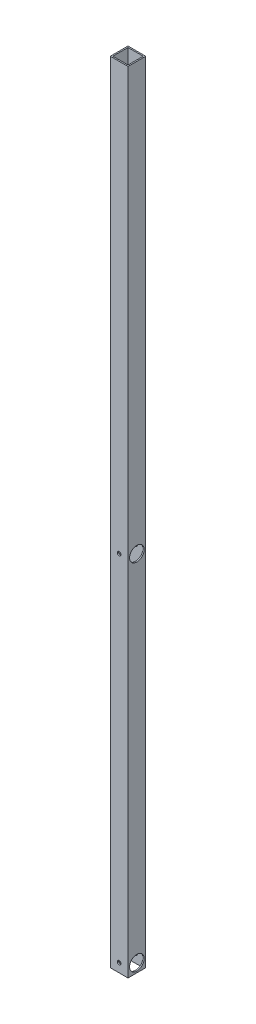
ISO-10303-21;
HEADER;
FILE_DESCRIPTION(('STEP AP214'),'2;1');
FILE_NAME('part.step','',(''),(''),'','','');
FILE_SCHEMA(('AUTOMOTIVE_DESIGN { 1 0 10303 214 1 1 1 1 }'));
ENDSEC;
DATA;
#1=APPLICATION_CONTEXT('core data for automotive mechanical design processes');
#2=APPLICATION_PROTOCOL_DEFINITION('international standard','automotive_design',2000,#1);
#3=PRODUCT_CONTEXT('',#1,'mechanical');
#4=PRODUCT('Part','Part','',(#3));
#5=PRODUCT_RELATED_PRODUCT_CATEGORY('part','',(#4));
#6=PRODUCT_DEFINITION_FORMATION('','',#4);
#7=PRODUCT_DEFINITION_CONTEXT('part definition',#1,'design');
#8=PRODUCT_DEFINITION('design','',#6,#7);
#9=PRODUCT_DEFINITION_SHAPE('','',#8);
#10=(LENGTH_UNIT() NAMED_UNIT(*) SI_UNIT(.MILLI.,.METRE.));
#11=(NAMED_UNIT(*) PLANE_ANGLE_UNIT() SI_UNIT($,.RADIAN.));
#12=(NAMED_UNIT(*) SI_UNIT($,.STERADIAN.) SOLID_ANGLE_UNIT());
#13=UNCERTAINTY_MEASURE_WITH_UNIT(LENGTH_MEASURE(1.E-05),#10,'distance_accuracy_value','');
#14=(GEOMETRIC_REPRESENTATION_CONTEXT(3) GLOBAL_UNCERTAINTY_ASSIGNED_CONTEXT((#13)) GLOBAL_UNIT_ASSIGNED_CONTEXT((#10,
#11,#12)) REPRESENTATION_CONTEXT('',''));
#15=CARTESIAN_POINT('',(0.,0.,0.));
#16=DIRECTION('',(0.,0.,1.));
#17=DIRECTION('',(1.,0.,0.));
#18=AXIS2_PLACEMENT_3D('',#15,#16,#17);
#19=CARTESIAN_POINT('',(22.225,22.225,0.));
#20=DIRECTION('',(0.,0.,1.));
#21=DIRECTION('',(1.,0.,0.));
#22=AXIS2_PLACEMENT_3D('',#19,#20,#21);
#23=CYLINDRICAL_SURFACE('',#22,4.7625);
#24=CARTESIAN_POINT('',(22.225,22.225,-41.275));
#25=DIRECTION('',(0.,0.,1.));
#26=DIRECTION('',(1.,0.,0.));
#27=AXIS2_PLACEMENT_3D('',#24,#25,#26);
#28=CIRCLE('',#27,4.7625);
#29=CARTESIAN_POINT('',(26.9875,22.225,-41.275));
#30=VERTEX_POINT('',#29);
#31=EDGE_CURVE('E122',#30,#30,#28,.F.);
#32=ORIENTED_EDGE('',*,*,#31,.F.);
#33=EDGE_LOOP('',(#32));
#34=FACE_BOUND('',#33,.T.);
#35=CARTESIAN_POINT('',(22.225,22.225,-44.45));
#36=DIRECTION('',(0.,0.,1.));
#37=DIRECTION('',(1.,0.,0.));
#38=AXIS2_PLACEMENT_3D('',#35,#36,#37);
#39=CIRCLE('',#38,4.7625);
#40=CARTESIAN_POINT('',(26.9875,22.225,-44.45));
#41=VERTEX_POINT('',#40);
#42=EDGE_CURVE('E19',#41,#41,#39,.T.);
#43=ORIENTED_EDGE('',*,*,#42,.F.);
#44=EDGE_LOOP('',(#43));
#45=FACE_BOUND('',#44,.T.);
#46=ADVANCED_FACE('F16',(#34,#45),#23,.F.);
#47=CARTESIAN_POINT('',(22.225,911.225,0.));
#48=DIRECTION('',(0.,0.,1.));
#49=DIRECTION('',(1.,0.,0.));
#50=AXIS2_PLACEMENT_3D('',#47,#48,#49);
#51=CYLINDRICAL_SURFACE('',#50,4.7625);
#52=CARTESIAN_POINT('',(22.225,911.225,-41.275));
#53=DIRECTION('',(0.,0.,1.));
#54=DIRECTION('',(1.,0.,0.));
#55=AXIS2_PLACEMENT_3D('',#52,#53,#54);
#56=CIRCLE('',#55,4.7625);
#57=CARTESIAN_POINT('',(26.9875,911.225,-41.275));
#58=VERTEX_POINT('',#57);
#59=EDGE_CURVE('E91',#58,#58,#56,.F.);
#60=ORIENTED_EDGE('',*,*,#59,.F.);
#61=EDGE_LOOP('',(#60));
#62=FACE_BOUND('',#61,.T.);
#63=CARTESIAN_POINT('',(22.225,911.225,-44.45));
#64=DIRECTION('',(0.,0.,1.));
#65=DIRECTION('',(1.,0.,0.));
#66=AXIS2_PLACEMENT_3D('',#63,#64,#65);
#67=CIRCLE('',#66,4.7625);
#68=CARTESIAN_POINT('',(26.9875,911.225,-44.45));
#69=VERTEX_POINT('',#68);
#70=EDGE_CURVE('E163',#69,#69,#67,.T.);
#71=ORIENTED_EDGE('',*,*,#70,.F.);
#72=EDGE_LOOP('',(#71));
#73=FACE_BOUND('',#72,.T.);
#74=ADVANCED_FACE('F174',(#62,#73),#51,.F.);
#75=CARTESIAN_POINT('',(44.45,22.225,-22.225));
#76=DIRECTION('',(1.,0.,0.));
#77=DIRECTION('',(0.,0.,-1.));
#78=AXIS2_PLACEMENT_3D('',#75,#76,#77);
#79=CYLINDRICAL_SURFACE('',#78,18.25625);
#80=CARTESIAN_POINT('',(41.275,22.225,-22.225));
#81=DIRECTION('',(1.,0.,0.));
#82=DIRECTION('',(0.,0.,-1.));
#83=AXIS2_PLACEMENT_3D('',#80,#81,#82);
#84=CIRCLE('',#83,18.25625);
#85=CARTESIAN_POINT('',(41.275,22.225,-40.48125));
#86=VERTEX_POINT('',#85);
#87=EDGE_CURVE('E161',#86,#86,#84,.T.);
#88=ORIENTED_EDGE('',*,*,#87,.F.);
#89=EDGE_LOOP('',(#88));
#90=FACE_BOUND('',#89,.T.);
#91=CARTESIAN_POINT('',(44.45,22.225,-22.225));
#92=DIRECTION('',(1.,0.,0.));
#93=DIRECTION('',(0.,0.,-1.));
#94=AXIS2_PLACEMENT_3D('',#91,#92,#93);
#95=CIRCLE('',#94,18.25625);
#96=CARTESIAN_POINT('',(44.45,22.225,-40.48125));
#97=VERTEX_POINT('',#96);
#98=EDGE_CURVE('E119',#97,#97,#95,.F.);
#99=ORIENTED_EDGE('',*,*,#98,.F.);
#100=EDGE_LOOP('',(#99));
#101=FACE_BOUND('',#100,.T.);
#102=ADVANCED_FACE('F180',(#90,#101),#79,.F.);
#103=CARTESIAN_POINT('',(44.45,911.225,-22.225));
#104=DIRECTION('',(1.,0.,0.));
#105=DIRECTION('',(0.,0.,-1.));
#106=AXIS2_PLACEMENT_3D('',#103,#104,#105);
#107=CYLINDRICAL_SURFACE('',#106,18.25625);
#108=CARTESIAN_POINT('',(41.275,911.225,-22.225));
#109=DIRECTION('',(1.,0.,0.));
#110=DIRECTION('',(0.,0.,-1.));
#111=AXIS2_PLACEMENT_3D('',#108,#109,#110);
#112=CIRCLE('',#111,18.25625);
#113=CARTESIAN_POINT('',(41.275,911.225,-40.48125));
#114=VERTEX_POINT('',#113);
#115=EDGE_CURVE('E158',#114,#114,#112,.T.);
#116=ORIENTED_EDGE('',*,*,#115,.F.);
#117=EDGE_LOOP('',(#116));
#118=FACE_BOUND('',#117,.T.);
#119=CARTESIAN_POINT('',(44.45,911.225,-22.225));
#120=DIRECTION('',(1.,0.,0.));
#121=DIRECTION('',(0.,0.,-1.));
#122=AXIS2_PLACEMENT_3D('',#119,#120,#121);
#123=CIRCLE('',#122,18.25625);
#124=CARTESIAN_POINT('',(44.45,911.225,-40.48125));
#125=VERTEX_POINT('',#124);
#126=EDGE_CURVE('E115',#125,#125,#123,.F.);
#127=ORIENTED_EDGE('',*,*,#126,.F.);
#128=EDGE_LOOP('',(#127));
#129=FACE_BOUND('',#128,.T.);
#130=ADVANCED_FACE('F236',(#118,#129),#107,.F.);
#131=CARTESIAN_POINT('',(44.45,22.225,-22.225));
#132=DIRECTION('',(1.,0.,0.));
#133=DIRECTION('',(0.,0.,-1.));
#134=AXIS2_PLACEMENT_3D('',#131,#132,#133);
#135=CYLINDRICAL_SURFACE('',#134,18.25625);
#136=CARTESIAN_POINT('',(3.175,22.225,-22.225));
#137=DIRECTION('',(1.,0.,0.));
#138=DIRECTION('',(0.,0.,-1.));
#139=AXIS2_PLACEMENT_3D('',#136,#137,#138);
#140=CIRCLE('',#139,18.25625);
#141=CARTESIAN_POINT('',(3.175,22.225,-40.48125));
#142=VERTEX_POINT('',#141);
#143=EDGE_CURVE('E155',#142,#142,#140,.F.);
#144=ORIENTED_EDGE('',*,*,#143,.F.);
#145=EDGE_LOOP('',(#144));
#146=FACE_BOUND('',#145,.T.);
#147=CARTESIAN_POINT('',(0.,22.225,-22.225));
#148=DIRECTION('',(1.,0.,0.));
#149=DIRECTION('',(0.,0.,-1.));
#150=AXIS2_PLACEMENT_3D('',#147,#148,#149);
#151=CIRCLE('',#150,18.25625);
#152=CARTESIAN_POINT('',(0.,22.225,-40.48125));
#153=VERTEX_POINT('',#152);
#154=EDGE_CURVE('E141',#153,#153,#151,.T.);
#155=ORIENTED_EDGE('',*,*,#154,.F.);
#156=EDGE_LOOP('',(#155));
#157=FACE_BOUND('',#156,.T.);
#158=ADVANCED_FACE('F232',(#146,#157),#135,.F.);
#159=CARTESIAN_POINT('',(44.45,911.225,-22.225));
#160=DIRECTION('',(1.,0.,0.));
#161=DIRECTION('',(0.,0.,-1.));
#162=AXIS2_PLACEMENT_3D('',#159,#160,#161);
#163=CYLINDRICAL_SURFACE('',#162,18.25625);
#164=CARTESIAN_POINT('',(3.175,911.225,-22.225));
#165=DIRECTION('',(1.,0.,0.));
#166=DIRECTION('',(0.,0.,-1.));
#167=AXIS2_PLACEMENT_3D('',#164,#165,#166);
#168=CIRCLE('',#167,18.25625);
#169=CARTESIAN_POINT('',(3.175,911.225,-40.48125));
#170=VERTEX_POINT('',#169);
#171=EDGE_CURVE('E124',#170,#170,#168,.F.);
#172=ORIENTED_EDGE('',*,*,#171,.F.);
#173=EDGE_LOOP('',(#172));
#174=FACE_BOUND('',#173,.T.);
#175=CARTESIAN_POINT('',(0.,911.225,-22.225));
#176=DIRECTION('',(1.,0.,0.));
#177=DIRECTION('',(0.,0.,-1.));
#178=AXIS2_PLACEMENT_3D('',#175,#176,#177);
#179=CIRCLE('',#178,18.25625);
#180=CARTESIAN_POINT('',(0.,911.225,-40.48125));
#181=VERTEX_POINT('',#180);
#182=EDGE_CURVE('E137',#181,#181,#179,.T.);
#183=ORIENTED_EDGE('',*,*,#182,.F.);
#184=EDGE_LOOP('',(#183));
#185=FACE_BOUND('',#184,.T.);
#186=ADVANCED_FACE('F229',(#174,#185),#163,.F.);
#187=CARTESIAN_POINT('',(44.45,0.,-44.45));
#188=DIRECTION('',(0.,0.,-1.));
#189=DIRECTION('',(-1.,0.,0.));
#190=AXIS2_PLACEMENT_3D('',#187,#188,#189);
#191=PLANE('',#190);
#192=ORIENTED_EDGE('',*,*,#70,.T.);
#193=EDGE_LOOP('',(#192));
#194=FACE_BOUND('',#193,.T.);
#195=ORIENTED_EDGE('',*,*,#42,.T.);
#196=EDGE_LOOP('',(#195));
#197=FACE_BOUND('',#196,.T.);
#198=DIRECTION('',(0.,1.,0.));
#199=VECTOR('',#198,1.);
#200=CARTESIAN_POINT('',(44.45,0.,-44.45));
#201=LINE('',#200,#199);
#202=CARTESIAN_POINT('',(44.45,0.,-44.45));
#203=VERTEX_POINT('',#202);
#204=CARTESIAN_POINT('',(44.45,1981.2,-44.45));
#205=VERTEX_POINT('',#204);
#206=EDGE_CURVE('E116',#203,#205,#201,.T.);
#207=ORIENTED_EDGE('',*,*,#206,.F.);
#208=DIRECTION('',(1.,0.,0.));
#209=VECTOR('',#208,1.);
#210=CARTESIAN_POINT('',(0.,0.,-44.45));
#211=LINE('',#210,#209);
#212=CARTESIAN_POINT('',(0.,0.,-44.45));
#213=VERTEX_POINT('',#212);
#214=EDGE_CURVE('E262',#203,#213,#211,.F.);
#215=ORIENTED_EDGE('',*,*,#214,.T.);
#216=DIRECTION('',(0.,1.,0.));
#217=VECTOR('',#216,1.);
#218=CARTESIAN_POINT('',(0.,0.,-44.45));
#219=LINE('',#218,#217);
#220=CARTESIAN_POINT('',(0.,1981.2,-44.45));
#221=VERTEX_POINT('',#220);
#222=EDGE_CURVE('E144',#221,#213,#219,.F.);
#223=ORIENTED_EDGE('',*,*,#222,.F.);
#224=DIRECTION('',(1.,0.,0.));
#225=VECTOR('',#224,1.);
#226=CARTESIAN_POINT('',(0.,1981.2,-44.45));
#227=LINE('',#226,#225);
#228=EDGE_CURVE('E107',#205,#221,#227,.F.);
#229=ORIENTED_EDGE('',*,*,#228,.F.);
#230=EDGE_LOOP('',(#207,#215,#223,#229));
#231=FACE_BOUND('',#230,.T.);
#232=ADVANCED_FACE('F170',(#194,#197,#231),#191,.T.);
#233=CARTESIAN_POINT('',(41.275,0.,-41.275));
#234=DIRECTION('',(-1.,0.,0.));
#235=DIRECTION('',(0.,0.,1.));
#236=AXIS2_PLACEMENT_3D('',#233,#234,#235);
#237=PLANE('',#236);
#238=ORIENTED_EDGE('',*,*,#115,.T.);
#239=EDGE_LOOP('',(#238));
#240=FACE_BOUND('',#239,.T.);
#241=ORIENTED_EDGE('',*,*,#87,.T.);
#242=EDGE_LOOP('',(#241));
#243=FACE_BOUND('',#242,.T.);
#244=DIRECTION('',(0.,1.,0.));
#245=VECTOR('',#244,1.);
#246=CARTESIAN_POINT('',(41.275,0.,-41.275));
#247=LINE('',#246,#245);
#248=CARTESIAN_POINT('',(41.275,0.,-41.275));
#249=VERTEX_POINT('',#248);
#250=CARTESIAN_POINT('',(41.275,1981.2,-41.275));
#251=VERTEX_POINT('',#250);
#252=EDGE_CURVE('E123',#249,#251,#247,.T.);
#253=ORIENTED_EDGE('',*,*,#252,.F.);
#254=DIRECTION('',(0.,0.,1.));
#255=VECTOR('',#254,1.);
#256=CARTESIAN_POINT('',(41.275,0.,0.));
#257=LINE('',#256,#255);
#258=CARTESIAN_POINT('',(41.275,0.,-3.175));
#259=VERTEX_POINT('',#258);
#260=EDGE_CURVE('E274',#249,#259,#257,.T.);
#261=ORIENTED_EDGE('',*,*,#260,.T.);
#262=DIRECTION('',(0.,1.,0.));
#263=VECTOR('',#262,1.);
#264=CARTESIAN_POINT('',(41.275,0.,-3.175));
#265=LINE('',#264,#263);
#266=CARTESIAN_POINT('',(41.275,1981.2,-3.175));
#267=VERTEX_POINT('',#266);
#268=EDGE_CURVE('E90',#267,#259,#265,.F.);
#269=ORIENTED_EDGE('',*,*,#268,.F.);
#270=DIRECTION('',(0.,0.,1.));
#271=VECTOR('',#270,1.);
#272=CARTESIAN_POINT('',(41.275,1981.2,0.));
#273=LINE('',#272,#271);
#274=EDGE_CURVE('E106',#251,#267,#273,.T.);
#275=ORIENTED_EDGE('',*,*,#274,.F.);
#276=EDGE_LOOP('',(#253,#261,#269,#275));
#277=FACE_BOUND('',#276,.T.);
#278=ADVANCED_FACE('F222',(#240,#243,#277),#237,.T.);
#279=CARTESIAN_POINT('',(3.175,0.,-3.175));
#280=DIRECTION('',(1.,0.,0.));
#281=DIRECTION('',(0.,0.,-1.));
#282=AXIS2_PLACEMENT_3D('',#279,#280,#281);
#283=PLANE('',#282);
#284=ORIENTED_EDGE('',*,*,#171,.T.);
#285=EDGE_LOOP('',(#284));
#286=FACE_BOUND('',#285,.T.);
#287=ORIENTED_EDGE('',*,*,#143,.T.);
#288=EDGE_LOOP('',(#287));
#289=FACE_BOUND('',#288,.T.);
#290=DIRECTION('',(0.,1.,0.));
#291=VECTOR('',#290,1.);
#292=CARTESIAN_POINT('',(3.175,0.,-3.175));
#293=LINE('',#292,#291);
#294=CARTESIAN_POINT('',(3.175,0.,-3.175));
#295=VERTEX_POINT('',#294);
#296=CARTESIAN_POINT('',(3.175,1981.2,-3.175));
#297=VERTEX_POINT('',#296);
#298=EDGE_CURVE('E79',#295,#297,#293,.T.);
#299=ORIENTED_EDGE('',*,*,#298,.F.);
#300=DIRECTION('',(0.,0.,1.));
#301=VECTOR('',#300,1.);
#302=CARTESIAN_POINT('',(3.175,0.,0.));
#303=LINE('',#302,#301);
#304=CARTESIAN_POINT('',(3.175,0.,-41.275));
#305=VERTEX_POINT('',#304);
#306=EDGE_CURVE('E271',#295,#305,#303,.F.);
#307=ORIENTED_EDGE('',*,*,#306,.T.);
#308=DIRECTION('',(0.,1.,0.));
#309=VECTOR('',#308,1.);
#310=CARTESIAN_POINT('',(3.175,0.,-41.275));
#311=LINE('',#310,#309);
#312=CARTESIAN_POINT('',(3.175,1981.2,-41.275));
#313=VERTEX_POINT('',#312);
#314=EDGE_CURVE('E97',#313,#305,#311,.F.);
#315=ORIENTED_EDGE('',*,*,#314,.F.);
#316=DIRECTION('',(0.,0.,1.));
#317=VECTOR('',#316,1.);
#318=CARTESIAN_POINT('',(3.175,1981.2,0.));
#319=LINE('',#318,#317);
#320=EDGE_CURVE('E94',#297,#313,#319,.F.);
#321=ORIENTED_EDGE('',*,*,#320,.F.);
#322=EDGE_LOOP('',(#299,#307,#315,#321));
#323=FACE_BOUND('',#322,.T.);
#324=ADVANCED_FACE('F95',(#286,#289,#323),#283,.T.);
#325=CARTESIAN_POINT('',(3.175,0.,-41.275));
#326=DIRECTION('',(0.,0.,1.));
#327=DIRECTION('',(1.,0.,0.));
#328=AXIS2_PLACEMENT_3D('',#325,#326,#327);
#329=PLANE('',#328);
#330=ORIENTED_EDGE('',*,*,#59,.T.);
#331=EDGE_LOOP('',(#330));
#332=FACE_BOUND('',#331,.T.);
#333=ORIENTED_EDGE('',*,*,#31,.T.);
#334=EDGE_LOOP('',(#333));
#335=FACE_BOUND('',#334,.T.);
#336=ORIENTED_EDGE('',*,*,#314,.T.);
#337=DIRECTION('',(1.,0.,0.));
#338=VECTOR('',#337,1.);
#339=CARTESIAN_POINT('',(0.,0.,-41.275));
#340=LINE('',#339,#338);
#341=EDGE_CURVE('E136',#305,#249,#340,.T.);
#342=ORIENTED_EDGE('',*,*,#341,.T.);
#343=ORIENTED_EDGE('',*,*,#252,.T.);
#344=DIRECTION('',(1.,0.,0.));
#345=VECTOR('',#344,1.);
#346=CARTESIAN_POINT('',(0.,1981.2,-41.275));
#347=LINE('',#346,#345);
#348=EDGE_CURVE('E101',#313,#251,#347,.T.);
#349=ORIENTED_EDGE('',*,*,#348,.F.);
#350=EDGE_LOOP('',(#336,#342,#343,#349));
#351=FACE_BOUND('',#350,.T.);
#352=ADVANCED_FACE('F215',(#332,#335,#351),#329,.T.);
#353=CARTESIAN_POINT('',(41.275,0.,-3.175));
#354=DIRECTION('',(0.,0.,-1.));
#355=DIRECTION('',(-1.,0.,0.));
#356=AXIS2_PLACEMENT_3D('',#353,#354,#355);
#357=PLANE('',#356);
#358=CARTESIAN_POINT('',(22.225,911.225,-3.175));
#359=DIRECTION('',(0.,0.,1.));
#360=DIRECTION('',(1.,0.,0.));
#361=AXIS2_PLACEMENT_3D('',#358,#359,#360);
#362=CIRCLE('',#361,4.7625);
#363=CARTESIAN_POINT('',(26.9875,911.225,-3.175));
#364=VERTEX_POINT('',#363);
#365=EDGE_CURVE('E129',#364,#364,#362,.T.);
#366=ORIENTED_EDGE('',*,*,#365,.T.);
#367=EDGE_LOOP('',(#366));
#368=FACE_BOUND('',#367,.T.);
#369=CARTESIAN_POINT('',(22.225,22.225,-3.175));
#370=DIRECTION('',(0.,0.,1.));
#371=DIRECTION('',(1.,0.,0.));
#372=AXIS2_PLACEMENT_3D('',#369,#370,#371);
#373=CIRCLE('',#372,4.7625);
#374=CARTESIAN_POINT('',(26.9875,22.225,-3.175));
#375=VERTEX_POINT('',#374);
#376=EDGE_CURVE('E133',#375,#375,#373,.T.);
#377=ORIENTED_EDGE('',*,*,#376,.T.);
#378=EDGE_LOOP('',(#377));
#379=FACE_BOUND('',#378,.T.);
#380=ORIENTED_EDGE('',*,*,#268,.T.);
#381=DIRECTION('',(1.,0.,0.));
#382=VECTOR('',#381,1.);
#383=CARTESIAN_POINT('',(0.,0.,-3.175));
#384=LINE('',#383,#382);
#385=EDGE_CURVE('E87',#259,#295,#384,.F.);
#386=ORIENTED_EDGE('',*,*,#385,.T.);
#387=ORIENTED_EDGE('',*,*,#298,.T.);
#388=DIRECTION('',(1.,0.,0.));
#389=VECTOR('',#388,1.);
#390=CARTESIAN_POINT('',(0.,1981.2,-3.175));
#391=LINE('',#390,#389);
#392=EDGE_CURVE('E84',#267,#297,#391,.F.);
#393=ORIENTED_EDGE('',*,*,#392,.F.);
#394=EDGE_LOOP('',(#380,#386,#387,#393));
#395=FACE_BOUND('',#394,.T.);
#396=ADVANCED_FACE('F82',(#368,#379,#395),#357,.T.);
#397=CARTESIAN_POINT('',(44.45,0.,0.));
#398=DIRECTION('',(1.,0.,0.));
#399=DIRECTION('',(0.,0.,-1.));
#400=AXIS2_PLACEMENT_3D('',#397,#398,#399);
#401=PLANE('',#400);
#402=ORIENTED_EDGE('',*,*,#126,.T.);
#403=EDGE_LOOP('',(#402));
#404=FACE_BOUND('',#403,.T.);
#405=ORIENTED_EDGE('',*,*,#98,.T.);
#406=EDGE_LOOP('',(#405));
#407=FACE_BOUND('',#406,.T.);
#408=DIRECTION('',(0.,1.,0.));
#409=VECTOR('',#408,1.);
#410=CARTESIAN_POINT('',(44.45,0.,0.));
#411=LINE('',#410,#409);
#412=CARTESIAN_POINT('',(44.45,0.,0.));
#413=VERTEX_POINT('',#412);
#414=CARTESIAN_POINT('',(44.45,1981.2,0.));
#415=VERTEX_POINT('',#414);
#416=EDGE_CURVE('E132',#413,#415,#411,.T.);
#417=ORIENTED_EDGE('',*,*,#416,.F.);
#418=DIRECTION('',(0.,0.,1.));
#419=VECTOR('',#418,1.);
#420=CARTESIAN_POINT('',(44.45,0.,0.));
#421=LINE('',#420,#419);
#422=EDGE_CURVE('E140',#413,#203,#421,.F.);
#423=ORIENTED_EDGE('',*,*,#422,.T.);
#424=ORIENTED_EDGE('',*,*,#206,.T.);
#425=DIRECTION('',(0.,0.,1.));
#426=VECTOR('',#425,1.);
#427=CARTESIAN_POINT('',(44.45,1981.2,0.));
#428=LINE('',#427,#426);
#429=EDGE_CURVE('E109',#415,#205,#428,.F.);
#430=ORIENTED_EDGE('',*,*,#429,.F.);
#431=EDGE_LOOP('',(#417,#423,#424,#430));
#432=FACE_BOUND('',#431,.T.);
#433=ADVANCED_FACE('F209',(#404,#407,#432),#401,.T.);
#434=CARTESIAN_POINT('',(0.,1981.2,0.));
#435=DIRECTION('',(0.,1.,0.));
#436=DIRECTION('',(0.,0.,1.));
#437=AXIS2_PLACEMENT_3D('',#434,#435,#436);
#438=PLANE('',#437);
#439=ORIENTED_EDGE('',*,*,#348,.T.);
#440=ORIENTED_EDGE('',*,*,#274,.T.);
#441=ORIENTED_EDGE('',*,*,#392,.T.);
#442=ORIENTED_EDGE('',*,*,#320,.T.);
#443=EDGE_LOOP('',(#439,#440,#441,#442));
#444=FACE_BOUND('',#443,.T.);
#445=DIRECTION('',(0.,0.,1.));
#446=VECTOR('',#445,1.);
#447=CARTESIAN_POINT('',(0.,1981.2,-44.45));
#448=LINE('',#447,#446);
#449=CARTESIAN_POINT('',(0.,1981.2,0.));
#450=VERTEX_POINT('',#449);
#451=EDGE_CURVE('E279',#450,#221,#448,.F.);
#452=ORIENTED_EDGE('',*,*,#451,.F.);
#453=DIRECTION('',(1.,0.,0.));
#454=VECTOR('',#453,1.);
#455=CARTESIAN_POINT('',(0.,1981.2,0.));
#456=LINE('',#455,#454);
#457=EDGE_CURVE('E258',#415,#450,#456,.F.);
#458=ORIENTED_EDGE('',*,*,#457,.F.);
#459=ORIENTED_EDGE('',*,*,#429,.T.);
#460=ORIENTED_EDGE('',*,*,#228,.T.);
#461=EDGE_LOOP('',(#452,#458,#459,#460));
#462=FACE_BOUND('',#461,.T.);
#463=ADVANCED_FACE('F103',(#444,#462),#438,.T.);
#464=CARTESIAN_POINT('',(0.,0.,-44.45));
#465=DIRECTION('',(-1.,0.,0.));
#466=DIRECTION('',(0.,0.,1.));
#467=AXIS2_PLACEMENT_3D('',#464,#465,#466);
#468=PLANE('',#467);
#469=ORIENTED_EDGE('',*,*,#182,.T.);
#470=EDGE_LOOP('',(#469));
#471=FACE_BOUND('',#470,.T.);
#472=ORIENTED_EDGE('',*,*,#154,.T.);
#473=EDGE_LOOP('',(#472));
#474=FACE_BOUND('',#473,.T.);
#475=ORIENTED_EDGE('',*,*,#222,.T.);
#476=DIRECTION('',(0.,0.,1.));
#477=VECTOR('',#476,1.);
#478=CARTESIAN_POINT('',(0.,0.,0.));
#479=LINE('',#478,#477);
#480=CARTESIAN_POINT('',(0.,0.,0.));
#481=VERTEX_POINT('',#480);
#482=EDGE_CURVE('E34',#213,#481,#479,.T.);
#483=ORIENTED_EDGE('',*,*,#482,.T.);
#484=DIRECTION('',(0.,1.,0.));
#485=VECTOR('',#484,1.);
#486=CARTESIAN_POINT('',(0.,0.,0.));
#487=LINE('',#486,#485);
#488=EDGE_CURVE('E264',#450,#481,#487,.F.);
#489=ORIENTED_EDGE('',*,*,#488,.F.);
#490=ORIENTED_EDGE('',*,*,#451,.T.);
#491=EDGE_LOOP('',(#475,#483,#489,#490));
#492=FACE_BOUND('',#491,.T.);
#493=ADVANCED_FACE('F202',(#471,#474,#492),#468,.T.);
#494=CARTESIAN_POINT('',(0.,0.,0.));
#495=DIRECTION('',(0.,1.,0.));
#496=DIRECTION('',(0.,0.,1.));
#497=AXIS2_PLACEMENT_3D('',#494,#495,#496);
#498=PLANE('',#497);
#499=ORIENTED_EDGE('',*,*,#306,.F.);
#500=ORIENTED_EDGE('',*,*,#385,.F.);
#501=ORIENTED_EDGE('',*,*,#260,.F.);
#502=ORIENTED_EDGE('',*,*,#341,.F.);
#503=EDGE_LOOP('',(#499,#500,#501,#502));
#504=FACE_BOUND('',#503,.T.);
#505=ORIENTED_EDGE('',*,*,#214,.F.);
#506=ORIENTED_EDGE('',*,*,#422,.F.);
#507=DIRECTION('',(1.,0.,0.));
#508=VECTOR('',#507,1.);
#509=CARTESIAN_POINT('',(0.,0.,0.));
#510=LINE('',#509,#508);
#511=EDGE_CURVE('E128',#481,#413,#510,.T.);
#512=ORIENTED_EDGE('',*,*,#511,.F.);
#513=ORIENTED_EDGE('',*,*,#482,.F.);
#514=EDGE_LOOP('',(#505,#506,#512,#513));
#515=FACE_BOUND('',#514,.T.);
#516=ADVANCED_FACE('F198',(#504,#515),#498,.F.);
#517=CARTESIAN_POINT('',(22.225,22.225,0.));
#518=DIRECTION('',(0.,0.,1.));
#519=DIRECTION('',(1.,0.,0.));
#520=AXIS2_PLACEMENT_3D('',#517,#518,#519);
#521=CYLINDRICAL_SURFACE('',#520,4.7625);
#522=ORIENTED_EDGE('',*,*,#376,.F.);
#523=EDGE_LOOP('',(#522));
#524=FACE_BOUND('',#523,.T.);
#525=CARTESIAN_POINT('',(22.225,22.225,0.));
#526=DIRECTION('',(0.,0.,1.));
#527=DIRECTION('',(1.,0.,0.));
#528=AXIS2_PLACEMENT_3D('',#525,#526,#527);
#529=CIRCLE('',#528,4.7625);
#530=CARTESIAN_POINT('',(26.9875,22.225,0.));
#531=VERTEX_POINT('',#530);
#532=EDGE_CURVE('E25',#531,#531,#529,.F.);
#533=ORIENTED_EDGE('',*,*,#532,.F.);
#534=EDGE_LOOP('',(#533));
#535=FACE_BOUND('',#534,.T.);
#536=ADVANCED_FACE('F191',(#524,#535),#521,.F.);
#537=CARTESIAN_POINT('',(22.225,911.225,0.));
#538=DIRECTION('',(0.,0.,1.));
#539=DIRECTION('',(1.,0.,0.));
#540=AXIS2_PLACEMENT_3D('',#537,#538,#539);
#541=CYLINDRICAL_SURFACE('',#540,4.7625);
#542=ORIENTED_EDGE('',*,*,#365,.F.);
#543=EDGE_LOOP('',(#542));
#544=FACE_BOUND('',#543,.T.);
#545=CARTESIAN_POINT('',(22.225,911.225,0.));
#546=DIRECTION('',(0.,0.,1.));
#547=DIRECTION('',(1.,0.,0.));
#548=AXIS2_PLACEMENT_3D('',#545,#546,#547);
#549=CIRCLE('',#548,4.7625);
#550=CARTESIAN_POINT('',(26.9875,911.225,0.));
#551=VERTEX_POINT('',#550);
#552=EDGE_CURVE('E11',#551,#551,#549,.F.);
#553=ORIENTED_EDGE('',*,*,#552,.F.);
#554=EDGE_LOOP('',(#553));
#555=FACE_BOUND('',#554,.T.);
#556=ADVANCED_FACE('F185',(#544,#555),#541,.F.);
#557=CARTESIAN_POINT('',(0.,0.,0.));
#558=DIRECTION('',(0.,0.,1.));
#559=DIRECTION('',(1.,0.,0.));
#560=AXIS2_PLACEMENT_3D('',#557,#558,#559);
#561=PLANE('',#560);
#562=ORIENTED_EDGE('',*,*,#552,.T.);
#563=EDGE_LOOP('',(#562));
#564=FACE_BOUND('',#563,.T.);
#565=ORIENTED_EDGE('',*,*,#532,.T.);
#566=EDGE_LOOP('',(#565));
#567=FACE_BOUND('',#566,.T.);
#568=ORIENTED_EDGE('',*,*,#488,.T.);
#569=ORIENTED_EDGE('',*,*,#511,.T.);
#570=ORIENTED_EDGE('',*,*,#416,.T.);
#571=ORIENTED_EDGE('',*,*,#457,.T.);
#572=EDGE_LOOP('',(#568,#569,#570,#571));
#573=FACE_BOUND('',#572,.T.);
#574=ADVANCED_FACE('F183',(#564,#567,#573),#561,.T.);
#575=CLOSED_SHELL('',(#46,#74,#102,#130,#158,#186,#232,#278,#324,#352,#396,#433,#463,#493,#516,
#536,#556,#574));
#576=MANIFOLD_SOLID_BREP('B1',#575);
#577=ADVANCED_BREP_SHAPE_REPRESENTATION('',(#18,#576),#14);
#578=SHAPE_DEFINITION_REPRESENTATION(#9,#577);
ENDSEC;
END-ISO-10303-21;
